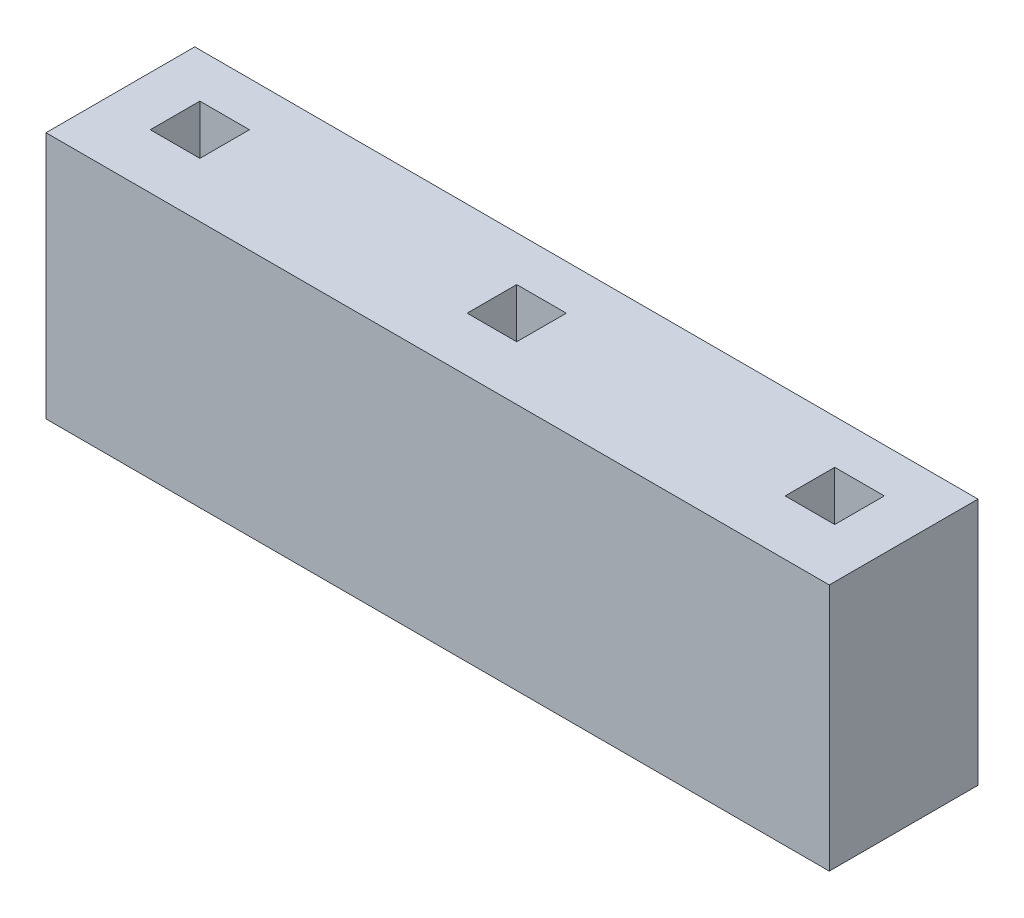
ISO-10303-21;
HEADER;
FILE_DESCRIPTION(('STEP AP214'),'2;1');
FILE_NAME('part.step','',(''),(''),'','','');
FILE_SCHEMA(('AUTOMOTIVE_DESIGN { 1 0 10303 214 1 1 1 1 }'));
ENDSEC;
DATA;
#1=APPLICATION_CONTEXT('core data for automotive mechanical design processes');
#2=APPLICATION_PROTOCOL_DEFINITION('international standard','automotive_design',2000,#1);
#3=PRODUCT_CONTEXT('',#1,'mechanical');
#4=PRODUCT('Part','Part','',(#3));
#5=PRODUCT_RELATED_PRODUCT_CATEGORY('part','',(#4));
#6=PRODUCT_DEFINITION_FORMATION('','',#4);
#7=PRODUCT_DEFINITION_CONTEXT('part definition',#1,'design');
#8=PRODUCT_DEFINITION('design','',#6,#7);
#9=PRODUCT_DEFINITION_SHAPE('','',#8);
#10=(LENGTH_UNIT() NAMED_UNIT(*) SI_UNIT(.MILLI.,.METRE.));
#11=(NAMED_UNIT(*) PLANE_ANGLE_UNIT() SI_UNIT($,.RADIAN.));
#12=(NAMED_UNIT(*) SI_UNIT($,.STERADIAN.) SOLID_ANGLE_UNIT());
#13=UNCERTAINTY_MEASURE_WITH_UNIT(LENGTH_MEASURE(1.E-05),#10,'distance_accuracy_value','');
#14=(GEOMETRIC_REPRESENTATION_CONTEXT(3) GLOBAL_UNCERTAINTY_ASSIGNED_CONTEXT((#13)) GLOBAL_UNIT_ASSIGNED_CONTEXT((#10,
#11,#12)) REPRESENTATION_CONTEXT('',''));
#15=CARTESIAN_POINT('',(0.,0.,0.));
#16=DIRECTION('',(0.,0.,1.));
#17=DIRECTION('',(1.,0.,0.));
#18=AXIS2_PLACEMENT_3D('',#15,#16,#17);
#19=CARTESIAN_POINT('',(0.,2.5,-0.561937798258988));
#20=DIRECTION('',(0.,0.,-1.));
#21=DIRECTION('',(-1.,0.,0.));
#22=AXIS2_PLACEMENT_3D('',#19,#20,#21);
#23=PLANE('',#22);
#24=DIRECTION('',(1.,0.,0.));
#25=VECTOR('',#24,1.);
#26=CARTESIAN_POINT('',(0.,0.,-0.561937798258988));
#27=LINE('',#26,#25);
#28=CARTESIAN_POINT('',(2.25512767831286,0.,-0.561937798258988));
#29=VERTEX_POINT('',#28);
#30=CARTESIAN_POINT('',(2.75512767831286,0.,-0.561937798258988));
#31=VERTEX_POINT('',#30);
#32=EDGE_CURVE('E238',#29,#31,#27,.T.);
#33=ORIENTED_EDGE('',*,*,#32,.T.);
#34=DIRECTION('',(0.,-1.,0.));
#35=VECTOR('',#34,1.);
#36=CARTESIAN_POINT('',(2.75512767831286,2.5,-0.561937798258988));
#37=LINE('',#36,#35);
#38=CARTESIAN_POINT('',(2.75512767831286,2.5,-0.561937798258988));
#39=VERTEX_POINT('',#38);
#40=EDGE_CURVE('E11',#39,#31,#37,.T.);
#41=ORIENTED_EDGE('',*,*,#40,.F.);
#42=DIRECTION('',(1.,0.,0.));
#43=VECTOR('',#42,1.);
#44=CARTESIAN_POINT('',(0.,2.5,-0.561937798258988));
#45=LINE('',#44,#43);
#46=CARTESIAN_POINT('',(2.25512767831286,2.5,-0.561937798258988));
#47=VERTEX_POINT('',#46);
#48=EDGE_CURVE('E170',#47,#39,#45,.T.);
#49=ORIENTED_EDGE('',*,*,#48,.F.);
#50=DIRECTION('',(0.,-1.,0.));
#51=VECTOR('',#50,1.);
#52=CARTESIAN_POINT('',(2.25512767831286,2.5,-0.561937798258988));
#53=LINE('',#52,#51);
#54=EDGE_CURVE('E61',#47,#29,#53,.T.);
#55=ORIENTED_EDGE('',*,*,#54,.T.);
#56=EDGE_LOOP('',(#33,#41,#49,#55));
#57=FACE_BOUND('',#56,.T.);
#58=ADVANCED_FACE('F41',(#57),#23,.F.);
#59=CARTESIAN_POINT('',(2.75512767831286,2.5,0.));
#60=DIRECTION('',(1.,0.,0.));
#61=DIRECTION('',(0.,0.,-1.));
#62=AXIS2_PLACEMENT_3D('',#59,#60,#61);
#63=PLANE('',#62);
#64=DIRECTION('',(0.,0.,1.));
#65=VECTOR('',#64,1.);
#66=CARTESIAN_POINT('',(2.75512767831286,0.,0.));
#67=LINE('',#66,#65);
#68=CARTESIAN_POINT('',(2.75512767831286,0.,-0.0619377982589881));
#69=VERTEX_POINT('',#68);
#70=EDGE_CURVE('E177',#31,#69,#67,.T.);
#71=ORIENTED_EDGE('',*,*,#70,.T.);
#72=DIRECTION('',(0.,-1.,0.));
#73=VECTOR('',#72,1.);
#74=CARTESIAN_POINT('',(2.75512767831286,2.5,-0.0619377982589881));
#75=LINE('',#74,#73);
#76=CARTESIAN_POINT('',(2.75512767831286,2.5,-0.0619377982589881));
#77=VERTEX_POINT('',#76);
#78=EDGE_CURVE('E52',#77,#69,#75,.T.);
#79=ORIENTED_EDGE('',*,*,#78,.F.);
#80=DIRECTION('',(0.,0.,1.));
#81=VECTOR('',#80,1.);
#82=CARTESIAN_POINT('',(2.75512767831286,2.5,0.));
#83=LINE('',#82,#81);
#84=EDGE_CURVE('E164',#39,#77,#83,.T.);
#85=ORIENTED_EDGE('',*,*,#84,.F.);
#86=ORIENTED_EDGE('',*,*,#40,.T.);
#87=EDGE_LOOP('',(#71,#79,#85,#86));
#88=FACE_BOUND('',#87,.T.);
#89=ADVANCED_FACE('F176',(#88),#63,.F.);
#90=CARTESIAN_POINT('',(0.,2.5,-0.0619377982589881));
#91=DIRECTION('',(0.,0.,-1.));
#92=DIRECTION('',(-1.,0.,0.));
#93=AXIS2_PLACEMENT_3D('',#90,#91,#92);
#94=PLANE('',#93);
#95=DIRECTION('',(1.,0.,0.));
#96=VECTOR('',#95,1.);
#97=CARTESIAN_POINT('',(0.,0.,-0.0619377982589881));
#98=LINE('',#97,#96);
#99=CARTESIAN_POINT('',(2.25512767831286,0.,-0.0619377982589881));
#100=VERTEX_POINT('',#99);
#101=EDGE_CURVE('E243',#100,#69,#98,.T.);
#102=ORIENTED_EDGE('',*,*,#101,.F.);
#103=DIRECTION('',(0.,-1.,0.));
#104=VECTOR('',#103,1.);
#105=CARTESIAN_POINT('',(2.25512767831286,2.5,-0.0619377982589881));
#106=LINE('',#105,#104);
#107=CARTESIAN_POINT('',(2.25512767831286,2.5,-0.0619377982589881));
#108=VERTEX_POINT('',#107);
#109=EDGE_CURVE('E111',#108,#100,#106,.T.);
#110=ORIENTED_EDGE('',*,*,#109,.F.);
#111=DIRECTION('',(1.,0.,0.));
#112=VECTOR('',#111,1.);
#113=CARTESIAN_POINT('',(0.,2.5,-0.0619377982589881));
#114=LINE('',#113,#112);
#115=EDGE_CURVE('E169',#108,#77,#114,.T.);
#116=ORIENTED_EDGE('',*,*,#115,.T.);
#117=ORIENTED_EDGE('',*,*,#78,.T.);
#118=EDGE_LOOP('',(#102,#110,#116,#117));
#119=FACE_BOUND('',#118,.T.);
#120=ADVANCED_FACE('F182',(#119),#94,.T.);
#121=CARTESIAN_POINT('',(5.45512767831286,2.5,0.));
#122=DIRECTION('',(1.,0.,0.));
#123=DIRECTION('',(0.,0.,-1.));
#124=AXIS2_PLACEMENT_3D('',#121,#122,#123);
#125=PLANE('',#124);
#126=DIRECTION('',(0.,0.,1.));
#127=VECTOR('',#126,1.);
#128=CARTESIAN_POINT('',(5.45512767831286,0.,0.));
#129=LINE('',#128,#127);
#130=CARTESIAN_POINT('',(5.45512767831286,0.,-0.569368520721016));
#131=VERTEX_POINT('',#130);
#132=CARTESIAN_POINT('',(5.45512767831286,0.,-0.069368520721016));
#133=VERTEX_POINT('',#132);
#134=EDGE_CURVE('E222',#131,#133,#129,.T.);
#135=ORIENTED_EDGE('',*,*,#134,.F.);
#136=DIRECTION('',(0.,-1.,0.));
#137=VECTOR('',#136,1.);
#138=CARTESIAN_POINT('',(5.45512767831286,2.5,-0.569368520721016));
#139=LINE('',#138,#137);
#140=CARTESIAN_POINT('',(5.45512767831286,2.5,-0.569368520721016));
#141=VERTEX_POINT('',#140);
#142=EDGE_CURVE('E252',#141,#131,#139,.T.);
#143=ORIENTED_EDGE('',*,*,#142,.F.);
#144=DIRECTION('',(0.,0.,1.));
#145=VECTOR('',#144,1.);
#146=CARTESIAN_POINT('',(5.45512767831286,2.5,0.));
#147=LINE('',#146,#145);
#148=CARTESIAN_POINT('',(5.45512767831286,2.5,-0.069368520721016));
#149=VERTEX_POINT('',#148);
#150=EDGE_CURVE('E334',#141,#149,#147,.T.);
#151=ORIENTED_EDGE('',*,*,#150,.T.);
#152=DIRECTION('',(0.,-1.,0.));
#153=VECTOR('',#152,1.);
#154=CARTESIAN_POINT('',(5.45512767831286,2.5,-0.069368520721016));
#155=LINE('',#154,#153);
#156=EDGE_CURVE('E255',#149,#133,#155,.T.);
#157=ORIENTED_EDGE('',*,*,#156,.T.);
#158=EDGE_LOOP('',(#135,#143,#151,#157));
#159=FACE_BOUND('',#158,.T.);
#160=ADVANCED_FACE('F365',(#159),#125,.T.);
#161=CARTESIAN_POINT('',(0.,2.5,-0.569368520721015));
#162=DIRECTION('',(0.,0.,-1.));
#163=DIRECTION('',(-1.,0.,0.));
#164=AXIS2_PLACEMENT_3D('',#161,#162,#163);
#165=PLANE('',#164);
#166=DIRECTION('',(1.,0.,0.));
#167=VECTOR('',#166,1.);
#168=CARTESIAN_POINT('',(0.,0.,-0.569368520721015));
#169=LINE('',#168,#167);
#170=CARTESIAN_POINT('',(5.95512767831287,0.,-0.569368520721016));
#171=VERTEX_POINT('',#170);
#172=EDGE_CURVE('E226',#131,#171,#169,.T.);
#173=ORIENTED_EDGE('',*,*,#172,.T.);
#174=DIRECTION('',(0.,-1.,0.));
#175=VECTOR('',#174,1.);
#176=CARTESIAN_POINT('',(5.95512767831287,2.5,-0.569368520721016));
#177=LINE('',#176,#175);
#178=CARTESIAN_POINT('',(5.95512767831287,2.5,-0.569368520721016));
#179=VERTEX_POINT('',#178);
#180=EDGE_CURVE('E262',#179,#171,#177,.T.);
#181=ORIENTED_EDGE('',*,*,#180,.F.);
#182=DIRECTION('',(1.,0.,0.));
#183=VECTOR('',#182,1.);
#184=CARTESIAN_POINT('',(0.,2.5,-0.569368520721015));
#185=LINE('',#184,#183);
#186=EDGE_CURVE('E338',#141,#179,#185,.T.);
#187=ORIENTED_EDGE('',*,*,#186,.F.);
#188=ORIENTED_EDGE('',*,*,#142,.T.);
#189=EDGE_LOOP('',(#173,#181,#187,#188));
#190=FACE_BOUND('',#189,.T.);
#191=ADVANCED_FACE('F367',(#190),#165,.F.);
#192=CARTESIAN_POINT('',(5.95512767831287,2.5,0.));
#193=DIRECTION('',(1.,0.,0.));
#194=DIRECTION('',(0.,0.,-1.));
#195=AXIS2_PLACEMENT_3D('',#192,#193,#194);
#196=PLANE('',#195);
#197=DIRECTION('',(0.,0.,1.));
#198=VECTOR('',#197,1.);
#199=CARTESIAN_POINT('',(5.95512767831287,0.,0.));
#200=LINE('',#199,#198);
#201=CARTESIAN_POINT('',(5.95512767831287,0.,-0.069368520721016));
#202=VERTEX_POINT('',#201);
#203=EDGE_CURVE('E230',#171,#202,#200,.T.);
#204=ORIENTED_EDGE('',*,*,#203,.T.);
#205=DIRECTION('',(0.,-1.,0.));
#206=VECTOR('',#205,1.);
#207=CARTESIAN_POINT('',(5.95512767831287,2.5,-0.069368520721016));
#208=LINE('',#207,#206);
#209=CARTESIAN_POINT('',(5.95512767831287,2.5,-0.069368520721016));
#210=VERTEX_POINT('',#209);
#211=EDGE_CURVE('E258',#210,#202,#208,.T.);
#212=ORIENTED_EDGE('',*,*,#211,.F.);
#213=DIRECTION('',(0.,0.,1.));
#214=VECTOR('',#213,1.);
#215=CARTESIAN_POINT('',(5.95512767831287,2.5,0.));
#216=LINE('',#215,#214);
#217=EDGE_CURVE('E342',#179,#210,#216,.T.);
#218=ORIENTED_EDGE('',*,*,#217,.F.);
#219=ORIENTED_EDGE('',*,*,#180,.T.);
#220=EDGE_LOOP('',(#204,#212,#218,#219));
#221=FACE_BOUND('',#220,.T.);
#222=ADVANCED_FACE('F359',(#221),#196,.F.);
#223=CARTESIAN_POINT('',(-0.944872321687136,2.5,0.));
#224=DIRECTION('',(1.,0.,0.));
#225=DIRECTION('',(0.,0.,-1.));
#226=AXIS2_PLACEMENT_3D('',#223,#224,#225);
#227=PLANE('',#226);
#228=DIRECTION('',(0.,0.,1.));
#229=VECTOR('',#228,1.);
#230=CARTESIAN_POINT('',(-0.944872321687136,0.,0.));
#231=LINE('',#230,#229);
#232=CARTESIAN_POINT('',(-0.944872321687136,0.,-0.566232633362133));
#233=VERTEX_POINT('',#232);
#234=CARTESIAN_POINT('',(-0.944872321687136,0.,-0.0662326333621327));
#235=VERTEX_POINT('',#234);
#236=EDGE_CURVE('E206',#233,#235,#231,.T.);
#237=ORIENTED_EDGE('',*,*,#236,.F.);
#238=DIRECTION('',(0.,-1.,0.));
#239=VECTOR('',#238,1.);
#240=CARTESIAN_POINT('',(-0.944872321687136,2.5,-0.566232633362133));
#241=LINE('',#240,#239);
#242=CARTESIAN_POINT('',(-0.944872321687136,2.5,-0.566232633362133));
#243=VERTEX_POINT('',#242);
#244=EDGE_CURVE('E259',#243,#233,#241,.T.);
#245=ORIENTED_EDGE('',*,*,#244,.F.);
#246=DIRECTION('',(0.,0.,1.));
#247=VECTOR('',#246,1.);
#248=CARTESIAN_POINT('',(-0.944872321687136,2.5,0.));
#249=LINE('',#248,#247);
#250=CARTESIAN_POINT('',(-0.944872321687136,2.5,-0.0662326333621327));
#251=VERTEX_POINT('',#250);
#252=EDGE_CURVE('E311',#243,#251,#249,.T.);
#253=ORIENTED_EDGE('',*,*,#252,.T.);
#254=DIRECTION('',(0.,-1.,0.));
#255=VECTOR('',#254,1.);
#256=CARTESIAN_POINT('',(-0.944872321687136,2.5,-0.0662326333621327));
#257=LINE('',#256,#255);
#258=EDGE_CURVE('E268',#251,#235,#257,.T.);
#259=ORIENTED_EDGE('',*,*,#258,.T.);
#260=EDGE_LOOP('',(#237,#245,#253,#259));
#261=FACE_BOUND('',#260,.T.);
#262=ADVANCED_FACE('F374',(#261),#227,.T.);
#263=CARTESIAN_POINT('',(0.,2.5,-0.566232633362133));
#264=DIRECTION('',(0.,0.,-1.));
#265=DIRECTION('',(-1.,0.,0.));
#266=AXIS2_PLACEMENT_3D('',#263,#264,#265);
#267=PLANE('',#266);
#268=DIRECTION('',(1.,0.,0.));
#269=VECTOR('',#268,1.);
#270=CARTESIAN_POINT('',(0.,0.,-0.566232633362133));
#271=LINE('',#270,#269);
#272=CARTESIAN_POINT('',(-0.444872321687135,0.,-0.566232633362133));
#273=VERTEX_POINT('',#272);
#274=EDGE_CURVE('E210',#233,#273,#271,.T.);
#275=ORIENTED_EDGE('',*,*,#274,.T.);
#276=DIRECTION('',(0.,-1.,0.));
#277=VECTOR('',#276,1.);
#278=CARTESIAN_POINT('',(-0.444872321687135,2.5,-0.566232633362133));
#279=LINE('',#278,#277);
#280=CARTESIAN_POINT('',(-0.444872321687135,2.5,-0.566232633362133));
#281=VERTEX_POINT('',#280);
#282=EDGE_CURVE('E274',#281,#273,#279,.T.);
#283=ORIENTED_EDGE('',*,*,#282,.F.);
#284=DIRECTION('',(1.,0.,0.));
#285=VECTOR('',#284,1.);
#286=CARTESIAN_POINT('',(0.,2.5,-0.566232633362133));
#287=LINE('',#286,#285);
#288=EDGE_CURVE('E323',#243,#281,#287,.T.);
#289=ORIENTED_EDGE('',*,*,#288,.F.);
#290=ORIENTED_EDGE('',*,*,#244,.T.);
#291=EDGE_LOOP('',(#275,#283,#289,#290));
#292=FACE_BOUND('',#291,.T.);
#293=ADVANCED_FACE('F403',(#292),#267,.F.);
#294=CARTESIAN_POINT('',(-0.444872321687135,2.5,0.));
#295=DIRECTION('',(1.,0.,0.));
#296=DIRECTION('',(0.,0.,-1.));
#297=AXIS2_PLACEMENT_3D('',#294,#295,#296);
#298=PLANE('',#297);
#299=DIRECTION('',(0.,0.,1.));
#300=VECTOR('',#299,1.);
#301=CARTESIAN_POINT('',(-0.444872321687135,0.,0.));
#302=LINE('',#301,#300);
#303=CARTESIAN_POINT('',(-0.444872321687135,0.,-0.0662326333621327));
#304=VERTEX_POINT('',#303);
#305=EDGE_CURVE('E214',#273,#304,#302,.T.);
#306=ORIENTED_EDGE('',*,*,#305,.T.);
#307=DIRECTION('',(0.,-1.,0.));
#308=VECTOR('',#307,1.);
#309=CARTESIAN_POINT('',(-0.444872321687135,2.5,-0.0662326333621327));
#310=LINE('',#309,#308);
#311=CARTESIAN_POINT('',(-0.444872321687135,2.5,-0.0662326333621327));
#312=VERTEX_POINT('',#311);
#313=EDGE_CURVE('E271',#312,#304,#310,.T.);
#314=ORIENTED_EDGE('',*,*,#313,.F.);
#315=DIRECTION('',(0.,0.,1.));
#316=VECTOR('',#315,1.);
#317=CARTESIAN_POINT('',(-0.444872321687135,2.5,0.));
#318=LINE('',#317,#316);
#319=EDGE_CURVE('E327',#281,#312,#318,.T.);
#320=ORIENTED_EDGE('',*,*,#319,.F.);
#321=ORIENTED_EDGE('',*,*,#282,.T.);
#322=EDGE_LOOP('',(#306,#314,#320,#321));
#323=FACE_BOUND('',#322,.T.);
#324=ADVANCED_FACE('F407',(#323),#298,.F.);
#325=CARTESIAN_POINT('',(0.,2.5,0.485685253863884));
#326=DIRECTION('',(0.,0.,-1.));
#327=DIRECTION('',(-1.,0.,0.));
#328=AXIS2_PLACEMENT_3D('',#325,#326,#327);
#329=PLANE('',#328);
#330=DIRECTION('',(1.,0.,0.));
#331=VECTOR('',#330,1.);
#332=CARTESIAN_POINT('',(0.,0.,0.485685253863884));
#333=LINE('',#332,#331);
#334=CARTESIAN_POINT('',(-1.44487232168714,0.,0.485685253863884));
#335=VERTEX_POINT('',#334);
#336=CARTESIAN_POINT('',(6.45512767831287,0.,0.485685253863884));
#337=VERTEX_POINT('',#336);
#338=EDGE_CURVE('E191',#335,#337,#333,.T.);
#339=ORIENTED_EDGE('',*,*,#338,.T.);
#340=DIRECTION('',(0.,-1.,0.));
#341=VECTOR('',#340,1.);
#342=CARTESIAN_POINT('',(6.45512767831287,2.5,0.485685253863884));
#343=LINE('',#342,#341);
#344=CARTESIAN_POINT('',(6.45512767831287,2.5,0.485685253863884));
#345=VERTEX_POINT('',#344);
#346=EDGE_CURVE('E45',#345,#337,#343,.T.);
#347=ORIENTED_EDGE('',*,*,#346,.F.);
#348=DIRECTION('',(1.,0.,0.));
#349=VECTOR('',#348,1.);
#350=CARTESIAN_POINT('',(0.,2.5,0.485685253863884));
#351=LINE('',#350,#349);
#352=CARTESIAN_POINT('',(-1.44487232168714,2.5,0.485685253863884));
#353=VERTEX_POINT('',#352);
#354=EDGE_CURVE('E124',#353,#345,#351,.T.);
#355=ORIENTED_EDGE('',*,*,#354,.F.);
#356=DIRECTION('',(0.,-1.,0.));
#357=VECTOR('',#356,1.);
#358=CARTESIAN_POINT('',(-1.44487232168714,2.5,0.485685253863884));
#359=LINE('',#358,#357);
#360=EDGE_CURVE('E187',#353,#335,#359,.T.);
#361=ORIENTED_EDGE('',*,*,#360,.T.);
#362=EDGE_LOOP('',(#339,#347,#355,#361));
#363=FACE_BOUND('',#362,.T.);
#364=ADVANCED_FACE('F43',(#363),#329,.F.);
#365=CARTESIAN_POINT('',(6.45512767831287,2.5,0.));
#366=DIRECTION('',(1.,0.,0.));
#367=DIRECTION('',(0.,0.,-1.));
#368=AXIS2_PLACEMENT_3D('',#365,#366,#367);
#369=PLANE('',#368);
#370=DIRECTION('',(0.,0.,1.));
#371=VECTOR('',#370,1.);
#372=CARTESIAN_POINT('',(6.45512767831287,0.,0.));
#373=LINE('',#372,#371);
#374=CARTESIAN_POINT('',(6.45512767831287,0.,-1.01431474613612));
#375=VERTEX_POINT('',#374);
#376=EDGE_CURVE('E195',#375,#337,#373,.T.);
#377=ORIENTED_EDGE('',*,*,#376,.F.);
#378=DIRECTION('',(0.,-1.,0.));
#379=VECTOR('',#378,1.);
#380=CARTESIAN_POINT('',(6.45512767831287,2.5,-1.01431474613612));
#381=LINE('',#380,#379);
#382=CARTESIAN_POINT('',(6.45512767831287,2.5,-1.01431474613612));
#383=VERTEX_POINT('',#382);
#384=EDGE_CURVE('E285',#383,#375,#381,.T.);
#385=ORIENTED_EDGE('',*,*,#384,.F.);
#386=DIRECTION('',(0.,0.,1.));
#387=VECTOR('',#386,1.);
#388=CARTESIAN_POINT('',(6.45512767831287,2.5,0.));
#389=LINE('',#388,#387);
#390=EDGE_CURVE('E295',#383,#345,#389,.T.);
#391=ORIENTED_EDGE('',*,*,#390,.T.);
#392=ORIENTED_EDGE('',*,*,#346,.T.);
#393=EDGE_LOOP('',(#377,#385,#391,#392));
#394=FACE_BOUND('',#393,.T.);
#395=ADVANCED_FACE('F294',(#394),#369,.T.);
#396=CARTESIAN_POINT('',(0.,2.5,-1.01431474613612));
#397=DIRECTION('',(0.,0.,-1.));
#398=DIRECTION('',(-1.,0.,0.));
#399=AXIS2_PLACEMENT_3D('',#396,#397,#398);
#400=PLANE('',#399);
#401=DIRECTION('',(1.,0.,0.));
#402=VECTOR('',#401,1.);
#403=CARTESIAN_POINT('',(0.,0.,-1.01431474613612));
#404=LINE('',#403,#402);
#405=CARTESIAN_POINT('',(-1.44487232168714,0.,-1.01431474613612));
#406=VERTEX_POINT('',#405);
#407=EDGE_CURVE('E199',#406,#375,#404,.T.);
#408=ORIENTED_EDGE('',*,*,#407,.F.);
#409=DIRECTION('',(0.,-1.,0.));
#410=VECTOR('',#409,1.);
#411=CARTESIAN_POINT('',(-1.44487232168714,2.5,-1.01431474613612));
#412=LINE('',#411,#410);
#413=CARTESIAN_POINT('',(-1.44487232168714,2.5,-1.01431474613612));
#414=VERTEX_POINT('',#413);
#415=EDGE_CURVE('E283',#414,#406,#412,.T.);
#416=ORIENTED_EDGE('',*,*,#415,.F.);
#417=DIRECTION('',(1.,0.,0.));
#418=VECTOR('',#417,1.);
#419=CARTESIAN_POINT('',(0.,2.5,-1.01431474613612));
#420=LINE('',#419,#418);
#421=EDGE_CURVE('E306',#414,#383,#420,.T.);
#422=ORIENTED_EDGE('',*,*,#421,.T.);
#423=ORIENTED_EDGE('',*,*,#384,.T.);
#424=EDGE_LOOP('',(#408,#416,#422,#423));
#425=FACE_BOUND('',#424,.T.);
#426=ADVANCED_FACE('F303',(#425),#400,.T.);
#427=CARTESIAN_POINT('',(0.,2.5,-0.0693685207210163));
#428=DIRECTION('',(0.,0.,-1.));
#429=DIRECTION('',(-1.,0.,0.));
#430=AXIS2_PLACEMENT_3D('',#427,#428,#429);
#431=PLANE('',#430);
#432=DIRECTION('',(1.,0.,0.));
#433=VECTOR('',#432,1.);
#434=CARTESIAN_POINT('',(0.,0.,-0.0693685207210163));
#435=LINE('',#434,#433);
#436=EDGE_CURVE('E234',#133,#202,#435,.T.);
#437=ORIENTED_EDGE('',*,*,#436,.F.);
#438=ORIENTED_EDGE('',*,*,#156,.F.);
#439=DIRECTION('',(1.,0.,0.));
#440=VECTOR('',#439,1.);
#441=CARTESIAN_POINT('',(0.,2.5,-0.0693685207210163));
#442=LINE('',#441,#440);
#443=EDGE_CURVE('E345',#149,#210,#442,.T.);
#444=ORIENTED_EDGE('',*,*,#443,.T.);
#445=ORIENTED_EDGE('',*,*,#211,.T.);
#446=EDGE_LOOP('',(#437,#438,#444,#445));
#447=FACE_BOUND('',#446,.T.);
#448=ADVANCED_FACE('F352',(#447),#431,.T.);
#449=CARTESIAN_POINT('',(0.,2.5,-0.0662326333621327));
#450=DIRECTION('',(0.,0.,-1.));
#451=DIRECTION('',(-1.,0.,0.));
#452=AXIS2_PLACEMENT_3D('',#449,#450,#451);
#453=PLANE('',#452);
#454=DIRECTION('',(1.,0.,0.));
#455=VECTOR('',#454,1.);
#456=CARTESIAN_POINT('',(0.,0.,-0.0662326333621327));
#457=LINE('',#456,#455);
#458=EDGE_CURVE('E218',#235,#304,#457,.T.);
#459=ORIENTED_EDGE('',*,*,#458,.F.);
#460=ORIENTED_EDGE('',*,*,#258,.F.);
#461=DIRECTION('',(1.,0.,0.));
#462=VECTOR('',#461,1.);
#463=CARTESIAN_POINT('',(0.,2.5,-0.0662326333621327));
#464=LINE('',#463,#462);
#465=EDGE_CURVE('E330',#251,#312,#464,.T.);
#466=ORIENTED_EDGE('',*,*,#465,.T.);
#467=ORIENTED_EDGE('',*,*,#313,.T.);
#468=EDGE_LOOP('',(#459,#460,#466,#467));
#469=FACE_BOUND('',#468,.T.);
#470=ADVANCED_FACE('F386',(#469),#453,.T.);
#471=CARTESIAN_POINT('',(-1.44487232168714,2.5,0.));
#472=DIRECTION('',(1.,0.,0.));
#473=DIRECTION('',(0.,0.,-1.));
#474=AXIS2_PLACEMENT_3D('',#471,#472,#473);
#475=PLANE('',#474);
#476=DIRECTION('',(0.,0.,1.));
#477=VECTOR('',#476,1.);
#478=CARTESIAN_POINT('',(-1.44487232168714,0.,0.));
#479=LINE('',#478,#477);
#480=EDGE_CURVE('E203',#406,#335,#479,.T.);
#481=ORIENTED_EDGE('',*,*,#480,.T.);
#482=ORIENTED_EDGE('',*,*,#360,.F.);
#483=DIRECTION('',(0.,0.,1.));
#484=VECTOR('',#483,1.);
#485=CARTESIAN_POINT('',(-1.44487232168714,2.5,0.));
#486=LINE('',#485,#484);
#487=EDGE_CURVE('E308',#414,#353,#486,.T.);
#488=ORIENTED_EDGE('',*,*,#487,.F.);
#489=ORIENTED_EDGE('',*,*,#415,.T.);
#490=EDGE_LOOP('',(#481,#482,#488,#489));
#491=FACE_BOUND('',#490,.T.);
#492=ADVANCED_FACE('F309',(#491),#475,.F.);
#493=CARTESIAN_POINT('',(2.25512767831286,2.5,0.));
#494=DIRECTION('',(1.,0.,0.));
#495=DIRECTION('',(0.,0.,-1.));
#496=AXIS2_PLACEMENT_3D('',#493,#494,#495);
#497=PLANE('',#496);
#498=DIRECTION('',(0.,0.,1.));
#499=VECTOR('',#498,1.);
#500=CARTESIAN_POINT('',(2.25512767831286,0.,0.));
#501=LINE('',#500,#499);
#502=EDGE_CURVE('E246',#29,#100,#501,.T.);
#503=ORIENTED_EDGE('',*,*,#502,.F.);
#504=ORIENTED_EDGE('',*,*,#54,.F.);
#505=DIRECTION('',(0.,0.,1.));
#506=VECTOR('',#505,1.);
#507=CARTESIAN_POINT('',(2.25512767831286,2.5,0.));
#508=LINE('',#507,#506);
#509=EDGE_CURVE('E184',#47,#108,#508,.T.);
#510=ORIENTED_EDGE('',*,*,#509,.T.);
#511=ORIENTED_EDGE('',*,*,#109,.T.);
#512=EDGE_LOOP('',(#503,#504,#510,#511));
#513=FACE_BOUND('',#512,.T.);
#514=ADVANCED_FACE('F400',(#513),#497,.T.);
#515=CARTESIAN_POINT('',(0.,2.5,0.));
#516=DIRECTION('',(0.,1.,0.));
#517=DIRECTION('',(0.,0.,1.));
#518=AXIS2_PLACEMENT_3D('',#515,#516,#517);
#519=PLANE('',#518);
#520=ORIENTED_EDGE('',*,*,#354,.T.);
#521=ORIENTED_EDGE('',*,*,#390,.F.);
#522=ORIENTED_EDGE('',*,*,#421,.F.);
#523=ORIENTED_EDGE('',*,*,#487,.T.);
#524=EDGE_LOOP('',(#520,#521,#522,#523));
#525=FACE_BOUND('',#524,.T.);
#526=ORIENTED_EDGE('',*,*,#252,.F.);
#527=ORIENTED_EDGE('',*,*,#288,.T.);
#528=ORIENTED_EDGE('',*,*,#319,.T.);
#529=ORIENTED_EDGE('',*,*,#465,.F.);
#530=EDGE_LOOP('',(#526,#527,#528,#529));
#531=FACE_BOUND('',#530,.T.);
#532=ORIENTED_EDGE('',*,*,#150,.F.);
#533=ORIENTED_EDGE('',*,*,#186,.T.);
#534=ORIENTED_EDGE('',*,*,#217,.T.);
#535=ORIENTED_EDGE('',*,*,#443,.F.);
#536=EDGE_LOOP('',(#532,#533,#534,#535));
#537=FACE_BOUND('',#536,.T.);
#538=ORIENTED_EDGE('',*,*,#48,.T.);
#539=ORIENTED_EDGE('',*,*,#84,.T.);
#540=ORIENTED_EDGE('',*,*,#115,.F.);
#541=ORIENTED_EDGE('',*,*,#509,.F.);
#542=EDGE_LOOP('',(#538,#539,#540,#541));
#543=FACE_BOUND('',#542,.T.);
#544=ADVANCED_FACE('F166',(#525,#531,#537,#543),#519,.T.);
#545=CARTESIAN_POINT('',(0.,0.,0.));
#546=DIRECTION('',(0.,1.,0.));
#547=DIRECTION('',(0.,0.,1.));
#548=AXIS2_PLACEMENT_3D('',#545,#546,#547);
#549=PLANE('',#548);
#550=ORIENTED_EDGE('',*,*,#338,.F.);
#551=ORIENTED_EDGE('',*,*,#480,.F.);
#552=ORIENTED_EDGE('',*,*,#407,.T.);
#553=ORIENTED_EDGE('',*,*,#376,.T.);
#554=EDGE_LOOP('',(#550,#551,#552,#553));
#555=FACE_BOUND('',#554,.T.);
#556=ORIENTED_EDGE('',*,*,#236,.T.);
#557=ORIENTED_EDGE('',*,*,#458,.T.);
#558=ORIENTED_EDGE('',*,*,#305,.F.);
#559=ORIENTED_EDGE('',*,*,#274,.F.);
#560=EDGE_LOOP('',(#556,#557,#558,#559));
#561=FACE_BOUND('',#560,.T.);
#562=ORIENTED_EDGE('',*,*,#134,.T.);
#563=ORIENTED_EDGE('',*,*,#436,.T.);
#564=ORIENTED_EDGE('',*,*,#203,.F.);
#565=ORIENTED_EDGE('',*,*,#172,.F.);
#566=EDGE_LOOP('',(#562,#563,#564,#565));
#567=FACE_BOUND('',#566,.T.);
#568=ORIENTED_EDGE('',*,*,#32,.F.);
#569=ORIENTED_EDGE('',*,*,#502,.T.);
#570=ORIENTED_EDGE('',*,*,#101,.T.);
#571=ORIENTED_EDGE('',*,*,#70,.F.);
#572=EDGE_LOOP('',(#568,#569,#570,#571));
#573=FACE_BOUND('',#572,.T.);
#574=ADVANCED_FACE('F301',(#555,#561,#567,#573),#549,.F.);
#575=CLOSED_SHELL('',(#58,#89,#120,#160,#191,#222,#262,#293,#324,#364,#395,#426,#448,#470,#492,
#514,#544,#574));
#576=MANIFOLD_SOLID_BREP('B2',#575);
#577=ADVANCED_BREP_SHAPE_REPRESENTATION('',(#18,#576),#14);
#578=SHAPE_DEFINITION_REPRESENTATION(#9,#577);
ENDSEC;
END-ISO-10303-21;
